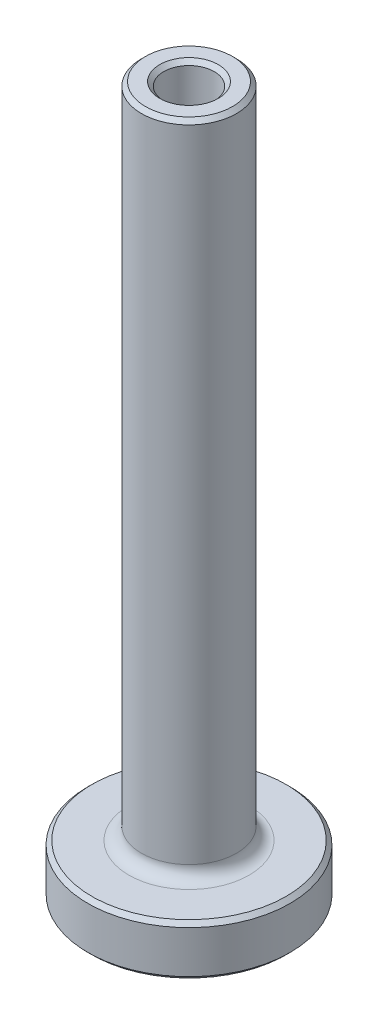
ISO-10303-21;
HEADER;
FILE_DESCRIPTION(('STEP AP214'),'2;1');
FILE_NAME('part.step','',(''),(''),'','','');
FILE_SCHEMA(('AUTOMOTIVE_DESIGN { 1 0 10303 214 1 1 1 1 }'));
ENDSEC;
DATA;
#1=APPLICATION_CONTEXT('core data for automotive mechanical design processes');
#2=APPLICATION_PROTOCOL_DEFINITION('international standard','automotive_design',2000,#1);
#3=PRODUCT_CONTEXT('',#1,'mechanical');
#4=PRODUCT('Part','Part','',(#3));
#5=PRODUCT_RELATED_PRODUCT_CATEGORY('part','',(#4));
#6=PRODUCT_DEFINITION_FORMATION('','',#4);
#7=PRODUCT_DEFINITION_CONTEXT('part definition',#1,'design');
#8=PRODUCT_DEFINITION('design','',#6,#7);
#9=PRODUCT_DEFINITION_SHAPE('','',#8);
#10=(LENGTH_UNIT() NAMED_UNIT(*) SI_UNIT(.MILLI.,.METRE.));
#11=(NAMED_UNIT(*) PLANE_ANGLE_UNIT() SI_UNIT($,.RADIAN.));
#12=(NAMED_UNIT(*) SI_UNIT($,.STERADIAN.) SOLID_ANGLE_UNIT());
#13=UNCERTAINTY_MEASURE_WITH_UNIT(LENGTH_MEASURE(1.E-05),#10,'distance_accuracy_value','');
#14=(GEOMETRIC_REPRESENTATION_CONTEXT(3) GLOBAL_UNCERTAINTY_ASSIGNED_CONTEXT((#13)) GLOBAL_UNIT_ASSIGNED_CONTEXT((#10,
#11,#12)) REPRESENTATION_CONTEXT('',''));
#15=CARTESIAN_POINT('',(0.,0.,0.));
#16=DIRECTION('',(0.,0.,1.));
#17=DIRECTION('',(1.,0.,0.));
#18=AXIS2_PLACEMENT_3D('',#15,#16,#17);
#19=CARTESIAN_POINT('',(6.35,0.,0.));
#20=DIRECTION('',(0.,1.,0.));
#21=DIRECTION('',(-1.,0.,0.));
#22=AXIS2_PLACEMENT_3D('',#19,#20,#21);
#23=PLANE('',#22);
#24=CARTESIAN_POINT('',(0.,0.,0.));
#25=DIRECTION('',(0.,1.,0.));
#26=DIRECTION('',(-1.,0.,0.));
#27=AXIS2_PLACEMENT_3D('',#24,#25,#26);
#28=CIRCLE('',#27,2.54000000000001);
#29=CARTESIAN_POINT('',(-2.54000000000001,0.,0.));
#30=VERTEX_POINT('',#29);
#31=EDGE_CURVE('E68',#30,#30,#28,.T.);
#32=ORIENTED_EDGE('',*,*,#31,.T.);
#33=EDGE_LOOP('',(#32));
#34=FACE_BOUND('',#33,.T.);
#35=CARTESIAN_POINT('',(0.,0.,0.));
#36=DIRECTION('',(0.,1.,0.));
#37=DIRECTION('',(-1.,0.,0.));
#38=AXIS2_PLACEMENT_3D('',#35,#36,#37);
#39=CIRCLE('',#38,6.09599999999999);
#40=CARTESIAN_POINT('',(-6.09599999999999,0.,0.));
#41=VERTEX_POINT('',#40);
#42=EDGE_CURVE('E71',#41,#41,#39,.F.);
#43=ORIENTED_EDGE('',*,*,#42,.T.);
#44=EDGE_LOOP('',(#43));
#45=FACE_BOUND('',#44,.T.);
#46=ADVANCED_FACE('F30',(#34,#45),#23,.F.);
#47=CARTESIAN_POINT('',(0.,5.29917562795115,0.));
#48=DIRECTION('',(0.,1.,0.));
#49=DIRECTION('',(-1.,0.,0.));
#50=AXIS2_PLACEMENT_3D('',#47,#48,#49);
#51=CYLINDRICAL_SURFACE('',#50,2.286);
#52=CARTESIAN_POINT('',(0.,0.254000000000004,0.));
#53=DIRECTION('',(0.,1.,0.));
#54=DIRECTION('',(-1.,0.,0.));
#55=AXIS2_PLACEMENT_3D('',#52,#53,#54);
#56=CIRCLE('',#55,2.286);
#57=CARTESIAN_POINT('',(-2.286,0.254000000000004,0.));
#58=VERTEX_POINT('',#57);
#59=EDGE_CURVE('E65',#58,#58,#56,.F.);
#60=ORIENTED_EDGE('',*,*,#59,.T.);
#61=EDGE_LOOP('',(#60));
#62=FACE_BOUND('',#61,.T.);
#63=CARTESIAN_POINT('',(0.,12.303125,0.));
#64=DIRECTION('',(0.,1.,0.));
#65=DIRECTION('',(-1.,0.,0.));
#66=AXIS2_PLACEMENT_3D('',#63,#64,#65);
#67=CIRCLE('',#66,2.286);
#68=CARTESIAN_POINT('',(-2.28600000000001,12.303125,0.));
#69=VERTEX_POINT('',#68);
#70=EDGE_CURVE('E83',#69,#69,#67,.T.);
#71=ORIENTED_EDGE('',*,*,#70,.T.);
#72=EDGE_LOOP('',(#71));
#73=FACE_BOUND('',#72,.T.);
#74=ADVANCED_FACE('F87',(#62,#73),#51,.F.);
#75=CARTESIAN_POINT('',(2.286,12.7,0.));
#76=DIRECTION('',(0.,1.,0.));
#77=DIRECTION('',(-1.,0.,0.));
#78=AXIS2_PLACEMENT_3D('',#75,#76,#77);
#79=PLANE('',#78);
#80=CARTESIAN_POINT('',(0.,12.7,0.));
#81=DIRECTION('',(0.,1.,0.));
#82=DIRECTION('',(-1.,0.,0.));
#83=AXIS2_PLACEMENT_3D('',#80,#81,#82);
#84=CIRCLE('',#83,1.71450000000002);
#85=CARTESIAN_POINT('',(-1.71450000000002,12.7,0.));
#86=VERTEX_POINT('',#85);
#87=EDGE_CURVE('E37',#86,#86,#84,.T.);
#88=ORIENTED_EDGE('',*,*,#87,.T.);
#89=EDGE_LOOP('',(#88));
#90=FACE_BOUND('',#89,.T.);
#91=CARTESIAN_POINT('',(0.,12.7,0.));
#92=DIRECTION('',(0.,1.,0.));
#93=DIRECTION('',(-1.,0.,0.));
#94=AXIS2_PLACEMENT_3D('',#91,#92,#93);
#95=CIRCLE('',#94,1.889125);
#96=CARTESIAN_POINT('',(-1.88912500000001,12.7,0.));
#97=VERTEX_POINT('',#96);
#98=EDGE_CURVE('E80',#97,#97,#95,.F.);
#99=ORIENTED_EDGE('',*,*,#98,.T.);
#100=EDGE_LOOP('',(#99));
#101=FACE_BOUND('',#100,.T.);
#102=ADVANCED_FACE('F112',(#90,#101),#79,.F.);
#103=CARTESIAN_POINT('',(0.,5.29917562795115,0.));
#104=DIRECTION('',(0.,1.,0.));
#105=DIRECTION('',(-1.,0.,0.));
#106=AXIS2_PLACEMENT_3D('',#103,#104,#105);
#107=CYLINDRICAL_SURFACE('',#106,1.58750000000001);
#108=CARTESIAN_POINT('',(0.,12.827,0.));
#109=DIRECTION('',(0.,1.,0.));
#110=DIRECTION('',(-1.,0.,0.));
#111=AXIS2_PLACEMENT_3D('',#108,#109,#110);
#112=CIRCLE('',#111,1.58750000000001);
#113=CARTESIAN_POINT('',(-1.58750000000001,12.827,0.));
#114=VERTEX_POINT('',#113);
#115=EDGE_CURVE('E10',#114,#114,#112,.F.);
#116=ORIENTED_EDGE('',*,*,#115,.T.);
#117=EDGE_LOOP('',(#116));
#118=FACE_BOUND('',#117,.T.);
#119=CARTESIAN_POINT('',(0.,44.196,0.));
#120=DIRECTION('',(0.,-1.,0.));
#121=DIRECTION('',(1.,0.,0.));
#122=AXIS2_PLACEMENT_3D('',#119,#120,#121);
#123=CIRCLE('',#122,1.58750000000001);
#124=CARTESIAN_POINT('',(1.58749999999999,44.196,0.));
#125=VERTEX_POINT('',#124);
#126=EDGE_CURVE('E45',#125,#125,#123,.F.);
#127=ORIENTED_EDGE('',*,*,#126,.T.);
#128=EDGE_LOOP('',(#127));
#129=FACE_BOUND('',#128,.T.);
#130=ADVANCED_FACE('F119',(#118,#129),#107,.F.);
#131=CARTESIAN_POINT('',(1.5875,44.45,0.));
#132=DIRECTION('',(0.,-1.,0.));
#133=DIRECTION('',(1.,0.,0.));
#134=AXIS2_PLACEMENT_3D('',#131,#132,#133);
#135=PLANE('',#134);
#136=CARTESIAN_POINT('',(0.,44.45,0.));
#137=DIRECTION('',(0.,-1.,0.));
#138=DIRECTION('',(1.,0.,0.));
#139=AXIS2_PLACEMENT_3D('',#136,#137,#138);
#140=CIRCLE('',#139,2.73050000000001);
#141=CARTESIAN_POINT('',(2.7305,44.45,0.));
#142=VERTEX_POINT('',#141);
#143=EDGE_CURVE('E53',#142,#142,#140,.F.);
#144=ORIENTED_EDGE('',*,*,#143,.T.);
#145=EDGE_LOOP('',(#144));
#146=FACE_BOUND('',#145,.T.);
#147=CARTESIAN_POINT('',(0.,44.45,0.));
#148=DIRECTION('',(0.,-1.,0.));
#149=DIRECTION('',(1.,0.,0.));
#150=AXIS2_PLACEMENT_3D('',#147,#148,#149);
#151=CIRCLE('',#150,1.84150000000002);
#152=CARTESIAN_POINT('',(1.8415,44.45,0.));
#153=VERTEX_POINT('',#152);
#154=EDGE_CURVE('E56',#153,#153,#151,.T.);
#155=ORIENTED_EDGE('',*,*,#154,.T.);
#156=EDGE_LOOP('',(#155));
#157=FACE_BOUND('',#156,.T.);
#158=ADVANCED_FACE('F122',(#146,#157),#135,.F.);
#159=CARTESIAN_POINT('',(0.,5.29917562795115,0.));
#160=DIRECTION('',(0.,1.,0.));
#161=DIRECTION('',(-1.,0.,0.));
#162=AXIS2_PLACEMENT_3D('',#159,#160,#161);
#163=CYLINDRICAL_SURFACE('',#162,2.98450000000001);
#164=CARTESIAN_POINT('',(0.,44.196,0.));
#165=DIRECTION('',(0.,-1.,0.));
#166=DIRECTION('',(1.,0.,0.));
#167=AXIS2_PLACEMENT_3D('',#164,#165,#166);
#168=CIRCLE('',#167,2.98450000000001);
#169=CARTESIAN_POINT('',(2.98449999999999,44.196,0.));
#170=VERTEX_POINT('',#169);
#171=EDGE_CURVE('E50',#170,#170,#168,.T.);
#172=ORIENTED_EDGE('',*,*,#171,.T.);
#173=EDGE_LOOP('',(#172));
#174=FACE_BOUND('',#173,.T.);
#175=CARTESIAN_POINT('',(0.,3.96875,0.));
#176=DIRECTION('',(0.,-1.,0.));
#177=DIRECTION('',(1.,0.,0.));
#178=AXIS2_PLACEMENT_3D('',#175,#176,#177);
#179=CIRCLE('',#178,2.98450000000001);
#180=CARTESIAN_POINT('',(2.9845,3.96875,0.));
#181=VERTEX_POINT('',#180);
#182=EDGE_CURVE('E77',#181,#181,#179,.F.);
#183=ORIENTED_EDGE('',*,*,#182,.T.);
#184=EDGE_LOOP('',(#183));
#185=FACE_BOUND('',#184,.T.);
#186=ADVANCED_FACE('F125',(#174,#185),#163,.T.);
#187=CARTESIAN_POINT('',(2.9845,3.175,0.));
#188=DIRECTION('',(0.,-1.,0.));
#189=DIRECTION('',(1.,0.,0.));
#190=AXIS2_PLACEMENT_3D('',#187,#188,#189);
#191=PLANE('',#190);
#192=CARTESIAN_POINT('',(0.,3.175,0.));
#193=DIRECTION('',(0.,-1.,0.));
#194=DIRECTION('',(1.,0.,0.));
#195=AXIS2_PLACEMENT_3D('',#192,#193,#194);
#196=CIRCLE('',#195,6.09600000000001);
#197=CARTESIAN_POINT('',(6.09600000000001,3.175,0.));
#198=VERTEX_POINT('',#197);
#199=EDGE_CURVE('E41',#198,#198,#196,.F.);
#200=ORIENTED_EDGE('',*,*,#199,.T.);
#201=EDGE_LOOP('',(#200));
#202=FACE_BOUND('',#201,.T.);
#203=CARTESIAN_POINT('',(0.,3.175,0.));
#204=DIRECTION('',(0.,-1.,0.));
#205=DIRECTION('',(1.,0.,0.));
#206=AXIS2_PLACEMENT_3D('',#203,#204,#205);
#207=CIRCLE('',#206,3.77825000000001);
#208=CARTESIAN_POINT('',(3.77825,3.175,0.));
#209=VERTEX_POINT('',#208);
#210=EDGE_CURVE('E74',#209,#209,#207,.T.);
#211=ORIENTED_EDGE('',*,*,#210,.T.);
#212=EDGE_LOOP('',(#211));
#213=FACE_BOUND('',#212,.T.);
#214=ADVANCED_FACE('F102',(#202,#213),#191,.F.);
#215=CARTESIAN_POINT('',(0.,5.29917562795115,0.));
#216=DIRECTION('',(0.,1.,0.));
#217=DIRECTION('',(-1.,0.,0.));
#218=AXIS2_PLACEMENT_3D('',#215,#216,#217);
#219=CYLINDRICAL_SURFACE('',#218,6.35);
#220=CARTESIAN_POINT('',(0.,0.254000000000002,0.));
#221=DIRECTION('',(0.,1.,0.));
#222=DIRECTION('',(-1.,0.,0.));
#223=AXIS2_PLACEMENT_3D('',#220,#221,#222);
#224=CIRCLE('',#223,6.35);
#225=CARTESIAN_POINT('',(-6.35,0.254,0.));
#226=VERTEX_POINT('',#225);
#227=EDGE_CURVE('E59',#226,#226,#224,.T.);
#228=ORIENTED_EDGE('',*,*,#227,.T.);
#229=EDGE_LOOP('',(#228));
#230=FACE_BOUND('',#229,.T.);
#231=CARTESIAN_POINT('',(0.,2.92100000000001,0.));
#232=DIRECTION('',(0.,-1.,0.));
#233=DIRECTION('',(1.,0.,0.));
#234=AXIS2_PLACEMENT_3D('',#231,#232,#233);
#235=CIRCLE('',#234,6.35);
#236=CARTESIAN_POINT('',(6.35,2.92100000000001,0.));
#237=VERTEX_POINT('',#236);
#238=EDGE_CURVE('E62',#237,#237,#235,.T.);
#239=ORIENTED_EDGE('',*,*,#238,.T.);
#240=EDGE_LOOP('',(#239));
#241=FACE_BOUND('',#240,.T.);
#242=ADVANCED_FACE('F92',(#230,#241),#219,.T.);
#243=CARTESIAN_POINT('',(0.,12.303125,0.));
#244=DIRECTION('',(0.,1.,0.));
#245=DIRECTION('',(-1.,0.,0.));
#246=AXIS2_PLACEMENT_3D('',#243,#244,#245);
#247=TOROIDAL_SURFACE('',#246,1.889125,0.396875);
#248=ORIENTED_EDGE('',*,*,#98,.F.);
#249=EDGE_LOOP('',(#248));
#250=FACE_BOUND('',#249,.T.);
#251=ORIENTED_EDGE('',*,*,#70,.F.);
#252=EDGE_LOOP('',(#251));
#253=FACE_BOUND('',#252,.T.);
#254=ADVANCED_FACE('F89',(#250,#253),#247,.F.);
#255=CARTESIAN_POINT('',(0.,3.96875,0.));
#256=DIRECTION('',(0.,-1.,0.));
#257=DIRECTION('',(1.,0.,0.));
#258=AXIS2_PLACEMENT_3D('',#255,#256,#257);
#259=TOROIDAL_SURFACE('',#258,3.77825000000001,0.79375);
#260=ORIENTED_EDGE('',*,*,#210,.F.);
#261=EDGE_LOOP('',(#260));
#262=FACE_BOUND('',#261,.T.);
#263=ORIENTED_EDGE('',*,*,#182,.F.);
#264=EDGE_LOOP('',(#263));
#265=FACE_BOUND('',#264,.T.);
#266=ADVANCED_FACE('F91',(#262,#265),#259,.F.);
#267=CARTESIAN_POINT('',(0.,0.,0.));
#268=DIRECTION('',(0.,-1.,0.));
#269=DIRECTION('',(1.,0.,0.));
#270=AXIS2_PLACEMENT_3D('',#267,#268,#269);
#271=CONICAL_SURFACE('',#270,2.54000000000001,0.78539816339745);
#272=ORIENTED_EDGE('',*,*,#59,.F.);
#273=EDGE_LOOP('',(#272));
#274=FACE_BOUND('',#273,.T.);
#275=ORIENTED_EDGE('',*,*,#31,.F.);
#276=EDGE_LOOP('',(#275));
#277=FACE_BOUND('',#276,.T.);
#278=ADVANCED_FACE('F99',(#274,#277),#271,.F.);
#279=CARTESIAN_POINT('',(0.,0.254000000000002,0.));
#280=DIRECTION('',(0.,1.,0.));
#281=DIRECTION('',(-1.,0.,0.));
#282=AXIS2_PLACEMENT_3D('',#279,#280,#281);
#283=CONICAL_SURFACE('',#282,6.35,0.785398163397462);
#284=ORIENTED_EDGE('',*,*,#42,.F.);
#285=EDGE_LOOP('',(#284));
#286=FACE_BOUND('',#285,.T.);
#287=ORIENTED_EDGE('',*,*,#227,.F.);
#288=EDGE_LOOP('',(#287));
#289=FACE_BOUND('',#288,.T.);
#290=ADVANCED_FACE('F157',(#286,#289),#283,.T.);
#291=CARTESIAN_POINT('',(0.,44.45,0.));
#292=DIRECTION('',(0.,-1.,0.));
#293=DIRECTION('',(1.,0.,0.));
#294=AXIS2_PLACEMENT_3D('',#291,#292,#293);
#295=CONICAL_SURFACE('',#294,2.73050000000001,0.785398163397458);
#296=ORIENTED_EDGE('',*,*,#171,.F.);
#297=EDGE_LOOP('',(#296));
#298=FACE_BOUND('',#297,.T.);
#299=ORIENTED_EDGE('',*,*,#143,.F.);
#300=EDGE_LOOP('',(#299));
#301=FACE_BOUND('',#300,.T.);
#302=ADVANCED_FACE('F150',(#298,#301),#295,.T.);
#303=CARTESIAN_POINT('',(0.,44.196,0.));
#304=DIRECTION('',(0.,1.,0.));
#305=DIRECTION('',(-1.,0.,0.));
#306=AXIS2_PLACEMENT_3D('',#303,#304,#305);
#307=CONICAL_SURFACE('',#306,1.58750000000001,0.785398163397442);
#308=ORIENTED_EDGE('',*,*,#154,.F.);
#309=EDGE_LOOP('',(#308));
#310=FACE_BOUND('',#309,.T.);
#311=ORIENTED_EDGE('',*,*,#126,.F.);
#312=EDGE_LOOP('',(#311));
#313=FACE_BOUND('',#312,.T.);
#314=ADVANCED_FACE('F143',(#310,#313),#307,.F.);
#315=CARTESIAN_POINT('',(0.,3.175,0.));
#316=DIRECTION('',(0.,-1.,0.));
#317=DIRECTION('',(1.,0.,0.));
#318=AXIS2_PLACEMENT_3D('',#315,#316,#317);
#319=CONICAL_SURFACE('',#318,6.09600000000001,0.785398163397447);
#320=ORIENTED_EDGE('',*,*,#238,.F.);
#321=EDGE_LOOP('',(#320));
#322=FACE_BOUND('',#321,.T.);
#323=ORIENTED_EDGE('',*,*,#199,.F.);
#324=EDGE_LOOP('',(#323));
#325=FACE_BOUND('',#324,.T.);
#326=ADVANCED_FACE('F141',(#322,#325),#319,.T.);
#327=CARTESIAN_POINT('',(0.,12.7,0.));
#328=DIRECTION('',(0.,-1.,0.));
#329=DIRECTION('',(1.,0.,0.));
#330=AXIS2_PLACEMENT_3D('',#327,#328,#329);
#331=CONICAL_SURFACE('',#330,1.71450000000002,0.785398163397479);
#332=ORIENTED_EDGE('',*,*,#115,.F.);
#333=EDGE_LOOP('',(#332));
#334=FACE_BOUND('',#333,.T.);
#335=ORIENTED_EDGE('',*,*,#87,.F.);
#336=EDGE_LOOP('',(#335));
#337=FACE_BOUND('',#336,.T.);
#338=ADVANCED_FACE('F32',(#334,#337),#331,.F.);
#339=CLOSED_SHELL('',(#46,#74,#102,#130,#158,#186,#214,#242,#254,#266,#278,#290,#302,#314,#326,#338));
#340=MANIFOLD_SOLID_BREP('B2',#339);
#341=ADVANCED_BREP_SHAPE_REPRESENTATION('',(#18,#340),#14);
#342=SHAPE_DEFINITION_REPRESENTATION(#9,#341);
ENDSEC;
END-ISO-10303-21;
